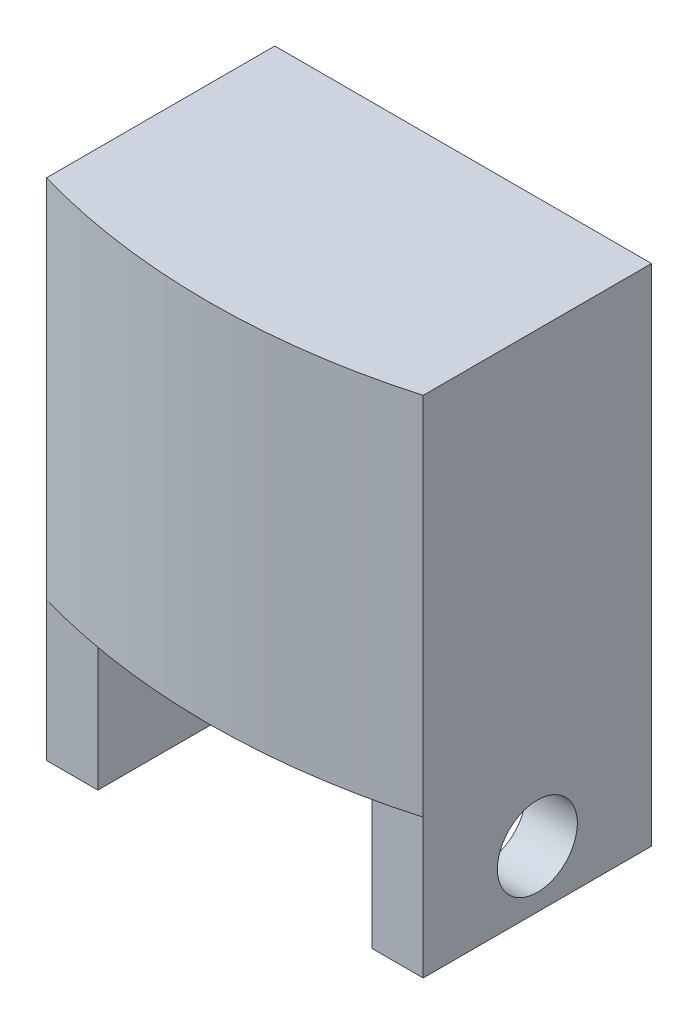
ISO-10303-21;
HEADER;
FILE_DESCRIPTION(('STEP AP214'),'2;1');
FILE_NAME('part.step','',(''),(''),'','','');
FILE_SCHEMA(('AUTOMOTIVE_DESIGN { 1 0 10303 214 1 1 1 1 }'));
ENDSEC;
DATA;
#1=APPLICATION_CONTEXT('core data for automotive mechanical design processes');
#2=APPLICATION_PROTOCOL_DEFINITION('international standard','automotive_design',2000,#1);
#3=PRODUCT_CONTEXT('',#1,'mechanical');
#4=PRODUCT('Part','Part','',(#3));
#5=PRODUCT_RELATED_PRODUCT_CATEGORY('part','',(#4));
#6=PRODUCT_DEFINITION_FORMATION('','',#4);
#7=PRODUCT_DEFINITION_CONTEXT('part definition',#1,'design');
#8=PRODUCT_DEFINITION('design','',#6,#7);
#9=PRODUCT_DEFINITION_SHAPE('','',#8);
#10=(LENGTH_UNIT() NAMED_UNIT(*) SI_UNIT(.MILLI.,.METRE.));
#11=(NAMED_UNIT(*) PLANE_ANGLE_UNIT() SI_UNIT($,.RADIAN.));
#12=(NAMED_UNIT(*) SI_UNIT($,.STERADIAN.) SOLID_ANGLE_UNIT());
#13=UNCERTAINTY_MEASURE_WITH_UNIT(LENGTH_MEASURE(1.E-05),#10,'distance_accuracy_value','');
#14=(GEOMETRIC_REPRESENTATION_CONTEXT(3) GLOBAL_UNCERTAINTY_ASSIGNED_CONTEXT((#13)) GLOBAL_UNIT_ASSIGNED_CONTEXT((#10,
#11,#12)) REPRESENTATION_CONTEXT('',''));
#15=CARTESIAN_POINT('',(0.,0.,0.));
#16=DIRECTION('',(0.,0.,1.));
#17=DIRECTION('',(1.,0.,0.));
#18=AXIS2_PLACEMENT_3D('',#15,#16,#17);
#19=CARTESIAN_POINT('',(0.,0.,-47.6866535690882));
#20=DIRECTION('',(0.,1.,0.));
#21=DIRECTION('',(0.,0.,1.));
#22=AXIS2_PLACEMENT_3D('',#19,#20,#21);
#23=PLANE('',#22);
#24=DIRECTION('',(1.,0.,0.));
#25=VECTOR('',#24,1.);
#26=CARTESIAN_POINT('',(12.,0.,9.99999999999999));
#27=LINE('',#26,#25);
#28=CARTESIAN_POINT('',(12.,0.,9.99999999999999));
#29=VERTEX_POINT('',#28);
#30=CARTESIAN_POINT('',(16.5,0.,10.));
#31=VERTEX_POINT('',#30);
#32=EDGE_CURVE('E123',#29,#31,#27,.T.);
#33=ORIENTED_EDGE('',*,*,#32,.T.);
#34=CARTESIAN_POINT('',(0.,0.,-47.6866535690882));
#35=DIRECTION('',(0.,1.,0.));
#36=DIRECTION('',(0.,0.,1.));
#37=AXIS2_PLACEMENT_3D('',#34,#35,#36);
#38=CIRCLE('',#37,60.);
#39=CARTESIAN_POINT('',(-16.5,0.,9.99999999999999));
#40=VERTEX_POINT('',#39);
#41=EDGE_CURVE('E214',#40,#31,#38,.T.);
#42=ORIENTED_EDGE('',*,*,#41,.F.);
#43=DIRECTION('',(-1.,0.,0.));
#44=VECTOR('',#43,1.);
#45=CARTESIAN_POINT('',(-12.,0.,9.99999999999999));
#46=LINE('',#45,#44);
#47=CARTESIAN_POINT('',(-12.,0.,9.99999999999999));
#48=VERTEX_POINT('',#47);
#49=EDGE_CURVE('E197',#48,#40,#46,.T.);
#50=ORIENTED_EDGE('',*,*,#49,.F.);
#51=DIRECTION('',(0.,0.,-1.));
#52=VECTOR('',#51,1.);
#53=CARTESIAN_POINT('',(-12.,0.,9.99999999999999));
#54=LINE('',#53,#52);
#55=CARTESIAN_POINT('',(-12.,0.,-7.5));
#56=VERTEX_POINT('',#55);
#57=EDGE_CURVE('E153',#48,#56,#54,.T.);
#58=ORIENTED_EDGE('',*,*,#57,.T.);
#59=CARTESIAN_POINT('',(-14.5,0.,-7.5));
#60=DIRECTION('',(0.,1.,0.));
#61=DIRECTION('',(0.,0.,1.));
#62=AXIS2_PLACEMENT_3D('',#59,#60,#61);
#63=CIRCLE('',#62,2.5);
#64=CARTESIAN_POINT('',(-14.5,0.,-10.));
#65=VERTEX_POINT('',#64);
#66=EDGE_CURVE('E41',#56,#65,#63,.T.);
#67=ORIENTED_EDGE('',*,*,#66,.T.);
#68=DIRECTION('',(1.,0.,0.));
#69=VECTOR('',#68,1.);
#70=CARTESIAN_POINT('',(-16.5,0.,-10.));
#71=LINE('',#70,#69);
#72=CARTESIAN_POINT('',(14.5,0.,-10.));
#73=VERTEX_POINT('',#72);
#74=EDGE_CURVE('E158',#65,#73,#71,.T.);
#75=ORIENTED_EDGE('',*,*,#74,.T.);
#76=CARTESIAN_POINT('',(14.5,0.,-7.5));
#77=DIRECTION('',(0.,1.,0.));
#78=DIRECTION('',(0.,0.,1.));
#79=AXIS2_PLACEMENT_3D('',#76,#77,#78);
#80=CIRCLE('',#79,2.5);
#81=CARTESIAN_POINT('',(12.,0.,-7.5));
#82=VERTEX_POINT('',#81);
#83=EDGE_CURVE('E11',#73,#82,#80,.T.);
#84=ORIENTED_EDGE('',*,*,#83,.T.);
#85=DIRECTION('',(0.,0.,-1.));
#86=VECTOR('',#85,1.);
#87=CARTESIAN_POINT('',(12.,0.,9.99999999999999));
#88=LINE('',#87,#86);
#89=EDGE_CURVE('E136',#29,#82,#88,.T.);
#90=ORIENTED_EDGE('',*,*,#89,.F.);
#91=EDGE_LOOP('',(#33,#42,#50,#58,#67,#75,#84,#90));
#92=FACE_BOUND('',#91,.T.);
#93=ADVANCED_FACE('F33',(#92),#23,.F.);
#94=CARTESIAN_POINT('',(-16.5,32.,-10.));
#95=DIRECTION('',(1.,0.,0.));
#96=DIRECTION('',(0.,0.,-1.));
#97=AXIS2_PLACEMENT_3D('',#94,#95,#96);
#98=PLANE('',#97);
#99=CARTESIAN_POINT('',(-16.5,24.5,0.));
#100=DIRECTION('',(-1.,0.,0.));
#101=DIRECTION('',(0.,0.,1.));
#102=AXIS2_PLACEMENT_3D('',#99,#100,#101);
#103=CIRCLE('',#102,3.5);
#104=CARTESIAN_POINT('',(-16.5,24.5,3.5));
#105=VERTEX_POINT('',#104);
#106=EDGE_CURVE('E416',#105,#105,#103,.T.);
#107=ORIENTED_EDGE('',*,*,#106,.F.);
#108=EDGE_LOOP('',(#107));
#109=FACE_BOUND('',#108,.T.);
#110=CARTESIAN_POINT('',(-16.5,-7.2,0.));
#111=DIRECTION('',(-1.,0.,0.));
#112=DIRECTION('',(0.,0.,1.));
#113=AXIS2_PLACEMENT_3D('',#110,#111,#112);
#114=CIRCLE('',#113,3.5);
#115=CARTESIAN_POINT('',(-16.5,-7.2,3.5));
#116=VERTEX_POINT('',#115);
#117=EDGE_CURVE('E415',#116,#116,#114,.T.);
#118=ORIENTED_EDGE('',*,*,#117,.F.);
#119=EDGE_LOOP('',(#118));
#120=FACE_BOUND('',#119,.T.);
#121=DIRECTION('',(0.,-1.,0.));
#122=VECTOR('',#121,1.);
#123=CARTESIAN_POINT('',(-16.5,32.,-10.));
#124=LINE('',#123,#122);
#125=CARTESIAN_POINT('',(-16.5,32.,-10.));
#126=VERTEX_POINT('',#125);
#127=CARTESIAN_POINT('',(-16.5,-12.2,-10.));
#128=VERTEX_POINT('',#127);
#129=EDGE_CURVE('E213',#126,#128,#124,.T.);
#130=ORIENTED_EDGE('',*,*,#129,.T.);
#131=DIRECTION('',(0.,0.,1.));
#132=VECTOR('',#131,1.);
#133=CARTESIAN_POINT('',(-16.5,-12.2,-10.));
#134=LINE('',#133,#132);
#135=CARTESIAN_POINT('',(-16.5,-12.2,9.99999999999999));
#136=VERTEX_POINT('',#135);
#137=EDGE_CURVE('E145',#128,#136,#134,.T.);
#138=ORIENTED_EDGE('',*,*,#137,.T.);
#139=DIRECTION('',(0.,1.,0.));
#140=VECTOR('',#139,1.);
#141=CARTESIAN_POINT('',(-16.5,-12.2,9.99999999999999));
#142=LINE('',#141,#140);
#143=EDGE_CURVE('E157',#136,#40,#142,.T.);
#144=ORIENTED_EDGE('',*,*,#143,.T.);
#145=DIRECTION('',(0.,-1.,0.));
#146=VECTOR('',#145,1.);
#147=CARTESIAN_POINT('',(-16.5,32.,9.99999999999999));
#148=LINE('',#147,#146);
#149=CARTESIAN_POINT('',(-16.5,32.,9.99999999999999));
#150=VERTEX_POINT('',#149);
#151=EDGE_CURVE('E169',#150,#40,#148,.T.);
#152=ORIENTED_EDGE('',*,*,#151,.F.);
#153=DIRECTION('',(0.,0.,1.));
#154=VECTOR('',#153,1.);
#155=CARTESIAN_POINT('',(-16.5,32.,-10.));
#156=LINE('',#155,#154);
#157=EDGE_CURVE('E202',#126,#150,#156,.T.);
#158=ORIENTED_EDGE('',*,*,#157,.F.);
#159=EDGE_LOOP('',(#130,#138,#144,#152,#158));
#160=FACE_BOUND('',#159,.T.);
#161=ADVANCED_FACE('F233',(#109,#120,#160),#98,.F.);
#162=CARTESIAN_POINT('',(0.,32.,-47.6866535690882));
#163=DIRECTION('',(0.,-1.,0.));
#164=DIRECTION('',(0.,0.,-1.));
#165=AXIS2_PLACEMENT_3D('',#162,#163,#164);
#166=CYLINDRICAL_SURFACE('',#165,60.);
#167=ORIENTED_EDGE('',*,*,#41,.T.);
#168=DIRECTION('',(0.,-1.,0.));
#169=VECTOR('',#168,1.);
#170=CARTESIAN_POINT('',(16.5,32.,10.));
#171=LINE('',#170,#169);
#172=CARTESIAN_POINT('',(16.5,32.,10.));
#173=VERTEX_POINT('',#172);
#174=EDGE_CURVE('E222',#173,#31,#171,.T.);
#175=ORIENTED_EDGE('',*,*,#174,.F.);
#176=CARTESIAN_POINT('',(0.,32.,-47.6866535690882));
#177=DIRECTION('',(0.,1.,0.));
#178=DIRECTION('',(0.,0.,1.));
#179=AXIS2_PLACEMENT_3D('',#176,#177,#178);
#180=CIRCLE('',#179,60.);
#181=EDGE_CURVE('E205',#150,#173,#180,.T.);
#182=ORIENTED_EDGE('',*,*,#181,.F.);
#183=ORIENTED_EDGE('',*,*,#151,.T.);
#184=EDGE_LOOP('',(#167,#175,#182,#183));
#185=FACE_BOUND('',#184,.T.);
#186=ADVANCED_FACE('F227',(#185),#166,.T.);
#187=CARTESIAN_POINT('',(16.5,32.,-10.));
#188=DIRECTION('',(1.,0.,0.));
#189=DIRECTION('',(0.,0.,-1.));
#190=AXIS2_PLACEMENT_3D('',#187,#188,#189);
#191=PLANE('',#190);
#192=CARTESIAN_POINT('',(16.5,-7.2,0.));
#193=DIRECTION('',(-1.,0.,0.));
#194=DIRECTION('',(0.,0.,1.));
#195=AXIS2_PLACEMENT_3D('',#192,#193,#194);
#196=CIRCLE('',#195,3.5);
#197=CARTESIAN_POINT('',(16.5,-7.2,3.5));
#198=VERTEX_POINT('',#197);
#199=EDGE_CURVE('E164',#198,#198,#196,.T.);
#200=ORIENTED_EDGE('',*,*,#199,.T.);
#201=EDGE_LOOP('',(#200));
#202=FACE_BOUND('',#201,.T.);
#203=ORIENTED_EDGE('',*,*,#174,.T.);
#204=DIRECTION('',(0.,1.,0.));
#205=VECTOR('',#204,1.);
#206=CARTESIAN_POINT('',(16.5,-12.2,9.99999999999999));
#207=LINE('',#206,#205);
#208=CARTESIAN_POINT('',(16.5,-12.2,9.99999999999999));
#209=VERTEX_POINT('',#208);
#210=EDGE_CURVE('E141',#209,#31,#207,.T.);
#211=ORIENTED_EDGE('',*,*,#210,.F.);
#212=DIRECTION('',(0.,0.,1.));
#213=VECTOR('',#212,1.);
#214=CARTESIAN_POINT('',(16.5,-12.2,-10.));
#215=LINE('',#214,#213);
#216=CARTESIAN_POINT('',(16.5,-12.2,-10.));
#217=VERTEX_POINT('',#216);
#218=EDGE_CURVE('E129',#217,#209,#215,.T.);
#219=ORIENTED_EDGE('',*,*,#218,.F.);
#220=DIRECTION('',(0.,-1.,0.));
#221=VECTOR('',#220,1.);
#222=CARTESIAN_POINT('',(16.5,32.,-10.));
#223=LINE('',#222,#221);
#224=CARTESIAN_POINT('',(16.5,32.,-10.));
#225=VERTEX_POINT('',#224);
#226=EDGE_CURVE('E219',#225,#217,#223,.T.);
#227=ORIENTED_EDGE('',*,*,#226,.F.);
#228=DIRECTION('',(0.,0.,1.));
#229=VECTOR('',#228,1.);
#230=CARTESIAN_POINT('',(16.5,32.,-10.));
#231=LINE('',#230,#229);
#232=EDGE_CURVE('E207',#225,#173,#231,.T.);
#233=ORIENTED_EDGE('',*,*,#232,.T.);
#234=EDGE_LOOP('',(#203,#211,#219,#227,#233));
#235=FACE_BOUND('',#234,.T.);
#236=ADVANCED_FACE('F240',(#202,#235),#191,.T.);
#237=CARTESIAN_POINT('',(-16.5,32.,-10.));
#238=DIRECTION('',(0.,0.,-1.));
#239=DIRECTION('',(-1.,0.,0.));
#240=AXIS2_PLACEMENT_3D('',#237,#238,#239);
#241=PLANE('',#240);
#242=ORIENTED_EDGE('',*,*,#74,.F.);
#243=DIRECTION('',(0.,-1.,0.));
#244=VECTOR('',#243,1.);
#245=CARTESIAN_POINT('',(-14.5,-12.2,-10.));
#246=LINE('',#245,#244);
#247=CARTESIAN_POINT('',(-14.5,-12.2,-10.));
#248=VERTEX_POINT('',#247);
#249=EDGE_CURVE('E168',#65,#248,#246,.T.);
#250=ORIENTED_EDGE('',*,*,#249,.T.);
#251=DIRECTION('',(-1.,0.,0.));
#252=VECTOR('',#251,1.);
#253=CARTESIAN_POINT('',(-12.,-12.2,-10.));
#254=LINE('',#253,#252);
#255=EDGE_CURVE('E187',#248,#128,#254,.T.);
#256=ORIENTED_EDGE('',*,*,#255,.T.);
#257=ORIENTED_EDGE('',*,*,#129,.F.);
#258=DIRECTION('',(1.,0.,0.));
#259=VECTOR('',#258,1.);
#260=CARTESIAN_POINT('',(-16.5,32.,-10.));
#261=LINE('',#260,#259);
#262=EDGE_CURVE('E210',#126,#225,#261,.T.);
#263=ORIENTED_EDGE('',*,*,#262,.T.);
#264=ORIENTED_EDGE('',*,*,#226,.T.);
#265=DIRECTION('',(1.,0.,0.));
#266=VECTOR('',#265,1.);
#267=CARTESIAN_POINT('',(12.,-12.2,-10.));
#268=LINE('',#267,#266);
#269=CARTESIAN_POINT('',(14.5,-12.2,-10.));
#270=VERTEX_POINT('',#269);
#271=EDGE_CURVE('E133',#270,#217,#268,.T.);
#272=ORIENTED_EDGE('',*,*,#271,.F.);
#273=DIRECTION('',(0.,-1.,0.));
#274=VECTOR('',#273,1.);
#275=CARTESIAN_POINT('',(14.5,0.,-10.));
#276=LINE('',#275,#274);
#277=EDGE_CURVE('E165',#270,#73,#276,.F.);
#278=ORIENTED_EDGE('',*,*,#277,.T.);
#279=EDGE_LOOP('',(#242,#250,#256,#257,#263,#264,#272,#278));
#280=FACE_BOUND('',#279,.T.);
#281=ADVANCED_FACE('F186',(#280),#241,.T.);
#282=CARTESIAN_POINT('',(0.,32.,-47.6866535690882));
#283=DIRECTION('',(0.,1.,0.));
#284=DIRECTION('',(0.,0.,1.));
#285=AXIS2_PLACEMENT_3D('',#282,#283,#284);
#286=PLANE('',#285);
#287=ORIENTED_EDGE('',*,*,#157,.T.);
#288=ORIENTED_EDGE('',*,*,#181,.T.);
#289=ORIENTED_EDGE('',*,*,#232,.F.);
#290=ORIENTED_EDGE('',*,*,#262,.F.);
#291=EDGE_LOOP('',(#287,#288,#289,#290));
#292=FACE_BOUND('',#291,.T.);
#293=ADVANCED_FACE('F243',(#292),#286,.T.);
#294=CARTESIAN_POINT('',(-12.,-12.2,9.99999999999999));
#295=DIRECTION('',(0.,0.,1.));
#296=DIRECTION('',(0.,-1.,0.));
#297=AXIS2_PLACEMENT_3D('',#294,#295,#296);
#298=PLANE('',#297);
#299=ORIENTED_EDGE('',*,*,#143,.F.);
#300=DIRECTION('',(-1.,0.,0.));
#301=VECTOR('',#300,1.);
#302=CARTESIAN_POINT('',(-12.,-12.2,9.99999999999999));
#303=LINE('',#302,#301);
#304=CARTESIAN_POINT('',(-12.,-12.2,9.99999999999999));
#305=VERTEX_POINT('',#304);
#306=EDGE_CURVE('E194',#305,#136,#303,.T.);
#307=ORIENTED_EDGE('',*,*,#306,.F.);
#308=DIRECTION('',(0.,1.,0.));
#309=VECTOR('',#308,1.);
#310=CARTESIAN_POINT('',(-12.,-12.2,9.99999999999999));
#311=LINE('',#310,#309);
#312=EDGE_CURVE('E195',#305,#48,#311,.T.);
#313=ORIENTED_EDGE('',*,*,#312,.T.);
#314=ORIENTED_EDGE('',*,*,#49,.T.);
#315=EDGE_LOOP('',(#299,#307,#313,#314));
#316=FACE_BOUND('',#315,.T.);
#317=ADVANCED_FACE('F288',(#316),#298,.T.);
#318=CARTESIAN_POINT('',(-12.,-12.2,-10.));
#319=DIRECTION('',(0.,-1.,0.));
#320=DIRECTION('',(0.,0.,-1.));
#321=AXIS2_PLACEMENT_3D('',#318,#319,#320);
#322=PLANE('',#321);
#323=ORIENTED_EDGE('',*,*,#255,.F.);
#324=CARTESIAN_POINT('',(-14.5,-12.2,-7.5));
#325=DIRECTION('',(0.,-1.,0.));
#326=DIRECTION('',(0.,0.,-1.));
#327=AXIS2_PLACEMENT_3D('',#324,#325,#326);
#328=CIRCLE('',#327,2.5);
#329=CARTESIAN_POINT('',(-12.,-12.2,-7.5));
#330=VERTEX_POINT('',#329);
#331=EDGE_CURVE('E172',#248,#330,#328,.T.);
#332=ORIENTED_EDGE('',*,*,#331,.T.);
#333=DIRECTION('',(0.,0.,1.));
#334=VECTOR('',#333,1.);
#335=CARTESIAN_POINT('',(-12.,-12.2,-10.));
#336=LINE('',#335,#334);
#337=EDGE_CURVE('E150',#330,#305,#336,.T.);
#338=ORIENTED_EDGE('',*,*,#337,.T.);
#339=ORIENTED_EDGE('',*,*,#306,.T.);
#340=ORIENTED_EDGE('',*,*,#137,.F.);
#341=EDGE_LOOP('',(#323,#332,#338,#339,#340));
#342=FACE_BOUND('',#341,.T.);
#343=ADVANCED_FACE('F191',(#342),#322,.T.);
#344=CARTESIAN_POINT('',(-12.,0.,0.));
#345=DIRECTION('',(-1.,0.,0.));
#346=DIRECTION('',(0.,0.,1.));
#347=AXIS2_PLACEMENT_3D('',#344,#345,#346);
#348=PLANE('',#347);
#349=CARTESIAN_POINT('',(-12.,-7.2,0.));
#350=DIRECTION('',(-1.,0.,0.));
#351=DIRECTION('',(0.,0.,1.));
#352=AXIS2_PLACEMENT_3D('',#349,#350,#351);
#353=CIRCLE('',#352,3.5);
#354=CARTESIAN_POINT('',(-12.,-7.2,3.5));
#355=VERTEX_POINT('',#354);
#356=EDGE_CURVE('E143',#355,#355,#353,.T.);
#357=ORIENTED_EDGE('',*,*,#356,.T.);
#358=EDGE_LOOP('',(#357));
#359=FACE_BOUND('',#358,.T.);
#360=ORIENTED_EDGE('',*,*,#337,.F.);
#361=DIRECTION('',(0.,-1.,0.));
#362=VECTOR('',#361,1.);
#363=CARTESIAN_POINT('',(-12.,0.,-7.5));
#364=LINE('',#363,#362);
#365=EDGE_CURVE('E174',#330,#56,#364,.F.);
#366=ORIENTED_EDGE('',*,*,#365,.T.);
#367=ORIENTED_EDGE('',*,*,#57,.F.);
#368=ORIENTED_EDGE('',*,*,#312,.F.);
#369=EDGE_LOOP('',(#360,#366,#367,#368));
#370=FACE_BOUND('',#369,.T.);
#371=ADVANCED_FACE('F298',(#359,#370),#348,.F.);
#372=CARTESIAN_POINT('',(12.,-12.2,-10.));
#373=DIRECTION('',(0.,1.,0.));
#374=DIRECTION('',(0.,0.,1.));
#375=AXIS2_PLACEMENT_3D('',#372,#373,#374);
#376=PLANE('',#375);
#377=DIRECTION('',(0.,0.,1.));
#378=VECTOR('',#377,1.);
#379=CARTESIAN_POINT('',(12.,-12.2,-10.));
#380=LINE('',#379,#378);
#381=CARTESIAN_POINT('',(12.,-12.2,-7.5));
#382=VERTEX_POINT('',#381);
#383=CARTESIAN_POINT('',(12.,-12.2,9.99999999999999));
#384=VERTEX_POINT('',#383);
#385=EDGE_CURVE('E115',#382,#384,#380,.T.);
#386=ORIENTED_EDGE('',*,*,#385,.F.);
#387=CARTESIAN_POINT('',(14.5,-12.2,-7.5));
#388=DIRECTION('',(0.,1.,0.));
#389=DIRECTION('',(0.,0.,1.));
#390=AXIS2_PLACEMENT_3D('',#387,#388,#389);
#391=CIRCLE('',#390,2.5);
#392=EDGE_CURVE('E48',#382,#270,#391,.F.);
#393=ORIENTED_EDGE('',*,*,#392,.T.);
#394=ORIENTED_EDGE('',*,*,#271,.T.);
#395=ORIENTED_EDGE('',*,*,#218,.T.);
#396=DIRECTION('',(1.,0.,0.));
#397=VECTOR('',#396,1.);
#398=CARTESIAN_POINT('',(12.,-12.2,9.99999999999999));
#399=LINE('',#398,#397);
#400=EDGE_CURVE('E126',#384,#209,#399,.T.);
#401=ORIENTED_EDGE('',*,*,#400,.F.);
#402=EDGE_LOOP('',(#386,#393,#394,#395,#401));
#403=FACE_BOUND('',#402,.T.);
#404=ADVANCED_FACE('F127',(#403),#376,.F.);
#405=CARTESIAN_POINT('',(12.,-12.2,9.99999999999999));
#406=DIRECTION('',(0.,0.,-1.));
#407=DIRECTION('',(0.,1.,0.));
#408=AXIS2_PLACEMENT_3D('',#405,#406,#407);
#409=PLANE('',#408);
#410=ORIENTED_EDGE('',*,*,#210,.T.);
#411=ORIENTED_EDGE('',*,*,#32,.F.);
#412=DIRECTION('',(0.,1.,0.));
#413=VECTOR('',#412,1.);
#414=CARTESIAN_POINT('',(12.,-12.2,9.99999999999999));
#415=LINE('',#414,#413);
#416=EDGE_CURVE('E119',#384,#29,#415,.T.);
#417=ORIENTED_EDGE('',*,*,#416,.F.);
#418=ORIENTED_EDGE('',*,*,#400,.T.);
#419=EDGE_LOOP('',(#410,#411,#417,#418));
#420=FACE_BOUND('',#419,.T.);
#421=ADVANCED_FACE('F135',(#420),#409,.F.);
#422=CARTESIAN_POINT('',(12.,0.,0.));
#423=DIRECTION('',(1.,0.,0.));
#424=DIRECTION('',(0.,0.,1.));
#425=AXIS2_PLACEMENT_3D('',#422,#423,#424);
#426=PLANE('',#425);
#427=CARTESIAN_POINT('',(12.,-7.2,0.));
#428=DIRECTION('',(1.,0.,0.));
#429=DIRECTION('',(0.,0.,-1.));
#430=AXIS2_PLACEMENT_3D('',#427,#428,#429);
#431=CIRCLE('',#430,3.5);
#432=CARTESIAN_POINT('',(12.,-7.2,-3.5));
#433=VERTEX_POINT('',#432);
#434=EDGE_CURVE('E161',#433,#433,#431,.T.);
#435=ORIENTED_EDGE('',*,*,#434,.T.);
#436=EDGE_LOOP('',(#435));
#437=FACE_BOUND('',#436,.T.);
#438=ORIENTED_EDGE('',*,*,#89,.T.);
#439=DIRECTION('',(0.,-1.,0.));
#440=VECTOR('',#439,1.);
#441=CARTESIAN_POINT('',(12.,-12.2,-7.5));
#442=LINE('',#441,#440);
#443=EDGE_CURVE('E121',#82,#382,#442,.T.);
#444=ORIENTED_EDGE('',*,*,#443,.T.);
#445=ORIENTED_EDGE('',*,*,#385,.T.);
#446=ORIENTED_EDGE('',*,*,#416,.T.);
#447=EDGE_LOOP('',(#438,#444,#445,#446));
#448=FACE_BOUND('',#447,.T.);
#449=ADVANCED_FACE('F117',(#437,#448),#426,.F.);
#450=CARTESIAN_POINT('',(16.5,-7.2,0.));
#451=DIRECTION('',(-1.,0.,0.));
#452=DIRECTION('',(0.,0.,1.));
#453=AXIS2_PLACEMENT_3D('',#450,#451,#452);
#454=CYLINDRICAL_SURFACE('',#453,3.5);
#455=ORIENTED_EDGE('',*,*,#199,.F.);
#456=EDGE_LOOP('',(#455));
#457=FACE_BOUND('',#456,.T.);
#458=ORIENTED_EDGE('',*,*,#434,.F.);
#459=EDGE_LOOP('',(#458));
#460=FACE_BOUND('',#459,.T.);
#461=ADVANCED_FACE('F322',(#457,#460),#454,.F.);
#462=ORIENTED_EDGE('',*,*,#117,.T.);
#463=EDGE_LOOP('',(#462));
#464=FACE_BOUND('',#463,.T.);
#465=ORIENTED_EDGE('',*,*,#356,.F.);
#466=EDGE_LOOP('',(#465));
#467=FACE_BOUND('',#466,.T.);
#468=ADVANCED_FACE('F330',(#464,#467),#454,.F.);
#469=CARTESIAN_POINT('',(-7.5,24.5,0.));
#470=DIRECTION('',(-1.,0.,0.));
#471=DIRECTION('',(0.,0.,1.));
#472=AXIS2_PLACEMENT_3D('',#469,#470,#471);
#473=CYLINDRICAL_SURFACE('',#472,3.5);
#474=CARTESIAN_POINT('',(-7.5,24.5,0.));
#475=DIRECTION('',(-1.,0.,0.));
#476=DIRECTION('',(0.,0.,1.));
#477=AXIS2_PLACEMENT_3D('',#474,#475,#476);
#478=CIRCLE('',#477,3.5);
#479=CARTESIAN_POINT('',(-7.5,24.5,3.5));
#480=VERTEX_POINT('',#479);
#481=EDGE_CURVE('E414',#480,#480,#478,.T.);
#482=ORIENTED_EDGE('',*,*,#481,.F.);
#483=EDGE_LOOP('',(#482));
#484=FACE_BOUND('',#483,.T.);
#485=ORIENTED_EDGE('',*,*,#106,.T.);
#486=EDGE_LOOP('',(#485));
#487=FACE_BOUND('',#486,.T.);
#488=ADVANCED_FACE('F338',(#484,#487),#473,.F.);
#489=CARTESIAN_POINT('',(-7.5,24.5,0.));
#490=DIRECTION('',(-1.,0.,0.));
#491=DIRECTION('',(0.,0.,1.));
#492=AXIS2_PLACEMENT_3D('',#489,#490,#491);
#493=PLANE('',#492);
#494=ORIENTED_EDGE('',*,*,#481,.T.);
#495=EDGE_LOOP('',(#494));
#496=FACE_BOUND('',#495,.T.);
#497=ADVANCED_FACE('F249',(#496),#493,.T.);
#498=CARTESIAN_POINT('',(-14.5,32.,-7.5));
#499=DIRECTION('',(0.,1.,0.));
#500=DIRECTION('',(0.,0.,1.));
#501=AXIS2_PLACEMENT_3D('',#498,#499,#500);
#502=CYLINDRICAL_SURFACE('',#501,2.5);
#503=ORIENTED_EDGE('',*,*,#66,.F.);
#504=ORIENTED_EDGE('',*,*,#365,.F.);
#505=ORIENTED_EDGE('',*,*,#331,.F.);
#506=ORIENTED_EDGE('',*,*,#249,.F.);
#507=EDGE_LOOP('',(#503,#504,#505,#506));
#508=FACE_BOUND('',#507,.T.);
#509=ADVANCED_FACE('F183',(#508),#502,.T.);
#510=CARTESIAN_POINT('',(14.5,0.,-7.5));
#511=DIRECTION('',(0.,1.,0.));
#512=DIRECTION('',(0.,0.,1.));
#513=AXIS2_PLACEMENT_3D('',#510,#511,#512);
#514=CYLINDRICAL_SURFACE('',#513,2.5);
#515=ORIENTED_EDGE('',*,*,#83,.F.);
#516=ORIENTED_EDGE('',*,*,#277,.F.);
#517=ORIENTED_EDGE('',*,*,#392,.F.);
#518=ORIENTED_EDGE('',*,*,#443,.F.);
#519=EDGE_LOOP('',(#515,#516,#517,#518));
#520=FACE_BOUND('',#519,.T.);
#521=ADVANCED_FACE('F35',(#520),#514,.T.);
#522=CLOSED_SHELL('',(#93,#161,#186,#236,#281,#293,#317,#343,#371,#404,#421,#449,#461,#468,#488,
#497,#509,#521));
#523=MANIFOLD_SOLID_BREP('B2',#522);
#524=ADVANCED_BREP_SHAPE_REPRESENTATION('',(#18,#523),#14);
#525=SHAPE_DEFINITION_REPRESENTATION(#9,#524);
ENDSEC;
END-ISO-10303-21;
